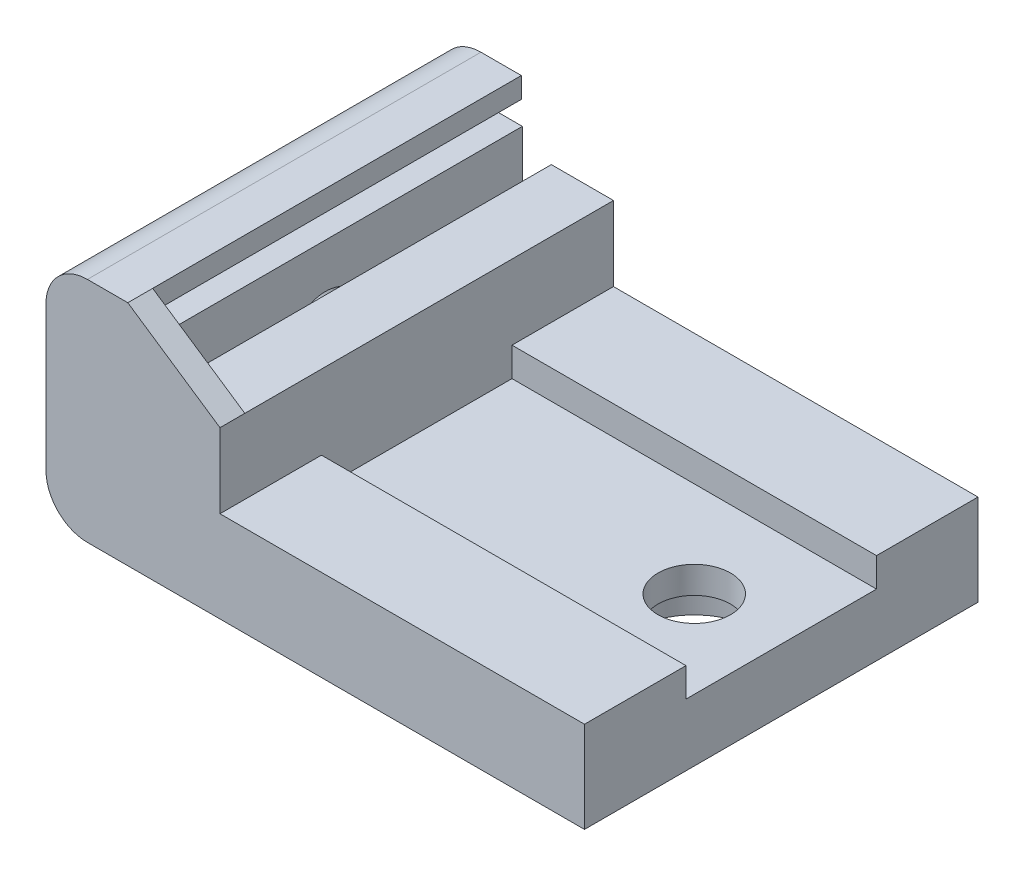
ISO-10303-21;
HEADER;
FILE_DESCRIPTION(('STEP AP214'),'2;1');
FILE_NAME('part.step','',(''),(''),'','','');
FILE_SCHEMA(('AUTOMOTIVE_DESIGN { 1 0 10303 214 1 1 1 1 }'));
ENDSEC;
DATA;
#1=APPLICATION_CONTEXT('core data for automotive mechanical design processes');
#2=APPLICATION_PROTOCOL_DEFINITION('international standard','automotive_design',2000,#1);
#3=PRODUCT_CONTEXT('',#1,'mechanical');
#4=PRODUCT('Part','Part','',(#3));
#5=PRODUCT_RELATED_PRODUCT_CATEGORY('part','',(#4));
#6=PRODUCT_DEFINITION_FORMATION('','',#4);
#7=PRODUCT_DEFINITION_CONTEXT('part definition',#1,'design');
#8=PRODUCT_DEFINITION('design','',#6,#7);
#9=PRODUCT_DEFINITION_SHAPE('','',#8);
#10=(LENGTH_UNIT() NAMED_UNIT(*) SI_UNIT(.MILLI.,.METRE.));
#11=(NAMED_UNIT(*) PLANE_ANGLE_UNIT() SI_UNIT($,.RADIAN.));
#12=(NAMED_UNIT(*) SI_UNIT($,.STERADIAN.) SOLID_ANGLE_UNIT());
#13=UNCERTAINTY_MEASURE_WITH_UNIT(LENGTH_MEASURE(1.E-05),#10,'distance_accuracy_value','');
#14=(GEOMETRIC_REPRESENTATION_CONTEXT(3) GLOBAL_UNCERTAINTY_ASSIGNED_CONTEXT((#13)) GLOBAL_UNIT_ASSIGNED_CONTEXT((#10,
#11,#12)) REPRESENTATION_CONTEXT('',''));
#15=CARTESIAN_POINT('',(0.,0.,0.));
#16=DIRECTION('',(0.,0.,1.));
#17=DIRECTION('',(1.,0.,0.));
#18=AXIS2_PLACEMENT_3D('',#15,#16,#17);
#19=CARTESIAN_POINT('',(0.,3.,0.));
#20=DIRECTION('',(0.,-1.,0.));
#21=DIRECTION('',(0.,0.,-1.));
#22=AXIS2_PLACEMENT_3D('',#19,#20,#21);
#23=PLANE('',#22);
#24=CARTESIAN_POINT('',(18.8,3.,-9.5));
#25=DIRECTION('',(0.,1.,0.));
#26=DIRECTION('',(0.,0.,1.));
#27=AXIS2_PLACEMENT_3D('',#24,#25,#26);
#28=CIRCLE('',#27,1.75);
#29=CARTESIAN_POINT('',(18.8,3.,-7.75));
#30=VERTEX_POINT('',#29);
#31=EDGE_CURVE('E285',#30,#30,#28,.T.);
#32=ORIENTED_EDGE('',*,*,#31,.F.);
#33=EDGE_LOOP('',(#32));
#34=FACE_BOUND('',#33,.T.);
#35=DIRECTION('',(1.,0.,0.));
#36=VECTOR('',#35,1.);
#37=CARTESIAN_POINT('',(23.,3.,-14.1));
#38=LINE('',#37,#36);
#39=CARTESIAN_POINT('',(5.4,3.,-14.1));
#40=VERTEX_POINT('',#39);
#41=CARTESIAN_POINT('',(23.,3.,-14.1));
#42=VERTEX_POINT('',#41);
#43=EDGE_CURVE('E232',#40,#42,#38,.T.);
#44=ORIENTED_EDGE('',*,*,#43,.F.);
#45=DIRECTION('',(0.,0.,-1.));
#46=VECTOR('',#45,1.);
#47=CARTESIAN_POINT('',(5.4,3.,0.));
#48=LINE('',#47,#46);
#49=CARTESIAN_POINT('',(5.4,3.,-4.9));
#50=VERTEX_POINT('',#49);
#51=EDGE_CURVE('E298',#50,#40,#48,.T.);
#52=ORIENTED_EDGE('',*,*,#51,.F.);
#53=DIRECTION('',(-1.,0.,0.));
#54=VECTOR('',#53,1.);
#55=CARTESIAN_POINT('',(5.4,3.,-4.9));
#56=LINE('',#55,#54);
#57=CARTESIAN_POINT('',(23.,3.,-4.9));
#58=VERTEX_POINT('',#57);
#59=EDGE_CURVE('E236',#58,#50,#56,.T.);
#60=ORIENTED_EDGE('',*,*,#59,.F.);
#61=DIRECTION('',(0.,0.,-1.));
#62=VECTOR('',#61,1.);
#63=CARTESIAN_POINT('',(23.,3.,0.));
#64=LINE('',#63,#62);
#65=EDGE_CURVE('E354',#58,#42,#64,.T.);
#66=ORIENTED_EDGE('',*,*,#65,.T.);
#67=EDGE_LOOP('',(#44,#52,#60,#66));
#68=FACE_BOUND('',#67,.T.);
#69=ADVANCED_FACE('F47',(#34,#68),#23,.F.);
#70=CARTESIAN_POINT('',(5.4,8.,0.));
#71=DIRECTION('',(-1.,0.,0.));
#72=DIRECTION('',(0.,0.,1.));
#73=AXIS2_PLACEMENT_3D('',#70,#71,#72);
#74=PLANE('',#73);
#75=DIRECTION('',(0.,-1.,0.));
#76=VECTOR('',#75,1.);
#77=CARTESIAN_POINT('',(5.4,4.4,-14.1));
#78=LINE('',#77,#76);
#79=CARTESIAN_POINT('',(5.4,4.4,-14.1));
#80=VERTEX_POINT('',#79);
#81=EDGE_CURVE('E216',#80,#40,#78,.T.);
#82=ORIENTED_EDGE('',*,*,#81,.F.);
#83=DIRECTION('',(0.,0.,1.));
#84=VECTOR('',#83,1.);
#85=CARTESIAN_POINT('',(5.4,4.4,-14.1));
#86=LINE('',#85,#84);
#87=CARTESIAN_POINT('',(5.4,4.4,-19.));
#88=VERTEX_POINT('',#87);
#89=EDGE_CURVE('E240',#88,#80,#86,.T.);
#90=ORIENTED_EDGE('',*,*,#89,.F.);
#91=DIRECTION('',(0.,-1.,0.));
#92=VECTOR('',#91,1.);
#93=CARTESIAN_POINT('',(5.4,8.,-19.));
#94=LINE('',#93,#92);
#95=CARTESIAN_POINT('',(5.4,8.,-19.));
#96=VERTEX_POINT('',#95);
#97=EDGE_CURVE('E344',#96,#88,#94,.T.);
#98=ORIENTED_EDGE('',*,*,#97,.F.);
#99=DIRECTION('',(0.,0.,-1.));
#100=VECTOR('',#99,1.);
#101=CARTESIAN_POINT('',(5.4,8.,0.));
#102=LINE('',#101,#100);
#103=CARTESIAN_POINT('',(5.4,8.,-1.2));
#104=VERTEX_POINT('',#103);
#105=EDGE_CURVE('E330',#104,#96,#102,.T.);
#106=ORIENTED_EDGE('',*,*,#105,.F.);
#107=CARTESIAN_POINT('',(5.4,8.,0.));
#108=VERTEX_POINT('',#107);
#109=EDGE_CURVE('E326',#108,#104,#102,.T.);
#110=ORIENTED_EDGE('',*,*,#109,.F.);
#111=DIRECTION('',(0.,-1.,0.));
#112=VECTOR('',#111,1.);
#113=CARTESIAN_POINT('',(5.4,8.,0.));
#114=LINE('',#113,#112);
#115=CARTESIAN_POINT('',(5.4,4.4,0.));
#116=VERTEX_POINT('',#115);
#117=EDGE_CURVE('E348',#108,#116,#114,.T.);
#118=ORIENTED_EDGE('',*,*,#117,.T.);
#119=DIRECTION('',(0.,0.,1.));
#120=VECTOR('',#119,1.);
#121=CARTESIAN_POINT('',(5.4,4.4,0.));
#122=LINE('',#121,#120);
#123=CARTESIAN_POINT('',(5.4,4.4,-4.9));
#124=VERTEX_POINT('',#123);
#125=EDGE_CURVE('E251',#124,#116,#122,.T.);
#126=ORIENTED_EDGE('',*,*,#125,.F.);
#127=DIRECTION('',(0.,-1.,0.));
#128=VECTOR('',#127,1.);
#129=CARTESIAN_POINT('',(5.4,4.4,-4.9));
#130=LINE('',#129,#128);
#131=EDGE_CURVE('E266',#124,#50,#130,.T.);
#132=ORIENTED_EDGE('',*,*,#131,.T.);
#133=ORIENTED_EDGE('',*,*,#51,.T.);
#134=EDGE_LOOP('',(#82,#90,#98,#106,#110,#118,#126,#132,#133));
#135=FACE_BOUND('',#134,.T.);
#136=ADVANCED_FACE('F440',(#135),#74,.F.);
#137=CARTESIAN_POINT('',(18.8,0.,-9.5));
#138=DIRECTION('',(0.,1.,0.));
#139=DIRECTION('',(0.,0.,1.));
#140=AXIS2_PLACEMENT_3D('',#137,#138,#139);
#141=CYLINDRICAL_SURFACE('',#140,1.75);
#142=ORIENTED_EDGE('',*,*,#31,.T.);
#143=EDGE_LOOP('',(#142));
#144=FACE_BOUND('',#143,.T.);
#145=CARTESIAN_POINT('',(18.8,1.7,-9.5));
#146=DIRECTION('',(0.,-1.,0.));
#147=DIRECTION('',(0.,0.,-1.));
#148=AXIS2_PLACEMENT_3D('',#145,#146,#147);
#149=CIRCLE('',#148,1.75);
#150=CARTESIAN_POINT('',(18.8,1.7,-11.25));
#151=VERTEX_POINT('',#150);
#152=EDGE_CURVE('E281',#151,#151,#149,.F.);
#153=ORIENTED_EDGE('',*,*,#152,.F.);
#154=EDGE_LOOP('',(#153));
#155=FACE_BOUND('',#154,.T.);
#156=ADVANCED_FACE('F531',(#144,#155),#141,.F.);
#157=CARTESIAN_POINT('',(0.,3.,0.));
#158=DIRECTION('',(0.,0.,-1.));
#159=DIRECTION('',(-1.,0.,0.));
#160=AXIS2_PLACEMENT_3D('',#157,#158,#159);
#161=PLANE('',#160);
#162=DIRECTION('',(0.,-1.,0.));
#163=VECTOR('',#162,1.);
#164=CARTESIAN_POINT('',(-3.,8.,0.));
#165=LINE('',#164,#163);
#166=CARTESIAN_POINT('',(-3.,9.,0.));
#167=VERTEX_POINT('',#166);
#168=CARTESIAN_POINT('',(-3.,2.,0.));
#169=VERTEX_POINT('',#168);
#170=EDGE_CURVE('E290',#167,#169,#165,.T.);
#171=ORIENTED_EDGE('',*,*,#170,.T.);
#172=CARTESIAN_POINT('',(-1.,2.,0.));
#173=DIRECTION('',(0.,0.,-1.));
#174=DIRECTION('',(-1.,0.,0.));
#175=AXIS2_PLACEMENT_3D('',#172,#173,#174);
#176=CIRCLE('',#175,2.);
#177=CARTESIAN_POINT('',(-1.,0.,0.));
#178=VERTEX_POINT('',#177);
#179=EDGE_CURVE('E11',#169,#178,#176,.F.);
#180=ORIENTED_EDGE('',*,*,#179,.T.);
#181=DIRECTION('',(1.,0.,0.));
#182=VECTOR('',#181,1.);
#183=CARTESIAN_POINT('',(0.,0.,0.));
#184=LINE('',#183,#182);
#185=CARTESIAN_POINT('',(23.,0.,0.));
#186=VERTEX_POINT('',#185);
#187=EDGE_CURVE('E353',#178,#186,#184,.T.);
#188=ORIENTED_EDGE('',*,*,#187,.T.);
#189=DIRECTION('',(0.,-1.,0.));
#190=VECTOR('',#189,1.);
#191=CARTESIAN_POINT('',(23.,3.,0.));
#192=LINE('',#191,#190);
#193=CARTESIAN_POINT('',(23.,4.4,0.));
#194=VERTEX_POINT('',#193);
#195=EDGE_CURVE('E369',#194,#186,#192,.T.);
#196=ORIENTED_EDGE('',*,*,#195,.F.);
#197=DIRECTION('',(1.,0.,0.));
#198=VECTOR('',#197,1.);
#199=CARTESIAN_POINT('',(5.4,4.4,0.));
#200=LINE('',#199,#198);
#201=EDGE_CURVE('E255',#116,#194,#200,.T.);
#202=ORIENTED_EDGE('',*,*,#201,.F.);
#203=ORIENTED_EDGE('',*,*,#117,.F.);
#204=DIRECTION('',(-0.829172554045034,0.558992733064067,0.));
#205=VECTOR('',#204,1.);
#206=CARTESIAN_POINT('',(0.95,11.,0.));
#207=LINE('',#206,#205);
#208=CARTESIAN_POINT('',(0.95,11.,0.));
#209=VERTEX_POINT('',#208);
#210=EDGE_CURVE('E209',#108,#209,#207,.T.);
#211=ORIENTED_EDGE('',*,*,#210,.T.);
#212=DIRECTION('',(-1.,0.,0.));
#213=VECTOR('',#212,1.);
#214=CARTESIAN_POINT('',(-3.,11.,0.));
#215=LINE('',#214,#213);
#216=CARTESIAN_POINT('',(-0.999999999999999,11.,0.));
#217=VERTEX_POINT('',#216);
#218=EDGE_CURVE('E293',#209,#217,#215,.T.);
#219=ORIENTED_EDGE('',*,*,#218,.T.);
#220=CARTESIAN_POINT('',(-1.,9.,0.));
#221=DIRECTION('',(0.,0.,-1.));
#222=DIRECTION('',(-1.,0.,0.));
#223=AXIS2_PLACEMENT_3D('',#220,#221,#222);
#224=CIRCLE('',#223,2.);
#225=EDGE_CURVE('E386',#217,#167,#224,.F.);
#226=ORIENTED_EDGE('',*,*,#225,.T.);
#227=EDGE_LOOP('',(#171,#180,#188,#196,#202,#203,#211,#219,#226));
#228=FACE_BOUND('',#227,.T.);
#229=ADVANCED_FACE('F419',(#228),#161,.F.);
#230=CARTESIAN_POINT('',(23.,3.,0.));
#231=DIRECTION('',(-1.,0.,0.));
#232=DIRECTION('',(0.,0.,1.));
#233=AXIS2_PLACEMENT_3D('',#230,#231,#232);
#234=PLANE('',#233);
#235=DIRECTION('',(0.,0.,-1.));
#236=VECTOR('',#235,1.);
#237=CARTESIAN_POINT('',(23.,0.,0.));
#238=LINE('',#237,#236);
#239=CARTESIAN_POINT('',(23.,0.,-19.));
#240=VERTEX_POINT('',#239);
#241=EDGE_CURVE('E361',#186,#240,#238,.T.);
#242=ORIENTED_EDGE('',*,*,#241,.T.);
#243=DIRECTION('',(0.,-1.,0.));
#244=VECTOR('',#243,1.);
#245=CARTESIAN_POINT('',(23.,3.,-19.));
#246=LINE('',#245,#244);
#247=CARTESIAN_POINT('',(23.,4.4,-19.));
#248=VERTEX_POINT('',#247);
#249=EDGE_CURVE('E357',#248,#240,#246,.T.);
#250=ORIENTED_EDGE('',*,*,#249,.F.);
#251=DIRECTION('',(0.,0.,-1.));
#252=VECTOR('',#251,1.);
#253=CARTESIAN_POINT('',(23.,4.4,-14.1));
#254=LINE('',#253,#252);
#255=CARTESIAN_POINT('',(23.,4.4,-14.1));
#256=VERTEX_POINT('',#255);
#257=EDGE_CURVE('E237',#256,#248,#254,.T.);
#258=ORIENTED_EDGE('',*,*,#257,.F.);
#259=DIRECTION('',(0.,-1.,0.));
#260=VECTOR('',#259,1.);
#261=CARTESIAN_POINT('',(23.,4.4,-14.1));
#262=LINE('',#261,#260);
#263=EDGE_CURVE('E221',#256,#42,#262,.T.);
#264=ORIENTED_EDGE('',*,*,#263,.T.);
#265=ORIENTED_EDGE('',*,*,#65,.F.);
#266=DIRECTION('',(0.,-1.,0.));
#267=VECTOR('',#266,1.);
#268=CARTESIAN_POINT('',(23.,4.4,-4.9));
#269=LINE('',#268,#267);
#270=CARTESIAN_POINT('',(23.,4.4,-4.9));
#271=VERTEX_POINT('',#270);
#272=EDGE_CURVE('E272',#271,#58,#269,.T.);
#273=ORIENTED_EDGE('',*,*,#272,.F.);
#274=DIRECTION('',(0.,0.,-1.));
#275=VECTOR('',#274,1.);
#276=CARTESIAN_POINT('',(23.,4.4,0.));
#277=LINE('',#276,#275);
#278=EDGE_CURVE('E259',#194,#271,#277,.T.);
#279=ORIENTED_EDGE('',*,*,#278,.F.);
#280=ORIENTED_EDGE('',*,*,#195,.T.);
#281=EDGE_LOOP('',(#242,#250,#258,#264,#265,#273,#279,#280));
#282=FACE_BOUND('',#281,.T.);
#283=ADVANCED_FACE('F430',(#282),#234,.F.);
#284=CARTESIAN_POINT('',(0.,3.,-19.));
#285=DIRECTION('',(0.,0.,1.));
#286=DIRECTION('',(1.,0.,0.));
#287=AXIS2_PLACEMENT_3D('',#284,#285,#286);
#288=PLANE('',#287);
#289=DIRECTION('',(-1.,0.,0.));
#290=VECTOR('',#289,1.);
#291=CARTESIAN_POINT('',(0.,0.,-19.));
#292=LINE('',#291,#290);
#293=CARTESIAN_POINT('',(-1.,0.,-19.));
#294=VERTEX_POINT('',#293);
#295=EDGE_CURVE('E358',#240,#294,#292,.T.);
#296=ORIENTED_EDGE('',*,*,#295,.T.);
#297=CARTESIAN_POINT('',(-1.,2.,-19.));
#298=DIRECTION('',(0.,0.,1.));
#299=DIRECTION('',(1.,0.,0.));
#300=AXIS2_PLACEMENT_3D('',#297,#298,#299);
#301=CIRCLE('',#300,2.);
#302=CARTESIAN_POINT('',(-3.,2.,-19.));
#303=VERTEX_POINT('',#302);
#304=EDGE_CURVE('E70',#294,#303,#301,.F.);
#305=ORIENTED_EDGE('',*,*,#304,.T.);
#306=DIRECTION('',(0.,1.,0.));
#307=VECTOR('',#306,1.);
#308=CARTESIAN_POINT('',(-3.,8.,-19.));
#309=LINE('',#308,#307);
#310=CARTESIAN_POINT('',(-3.,9.,-19.));
#311=VERTEX_POINT('',#310);
#312=EDGE_CURVE('E289',#303,#311,#309,.T.);
#313=ORIENTED_EDGE('',*,*,#312,.T.);
#314=CARTESIAN_POINT('',(-1.,9.,-19.));
#315=DIRECTION('',(0.,0.,1.));
#316=DIRECTION('',(1.,0.,0.));
#317=AXIS2_PLACEMENT_3D('',#314,#315,#316);
#318=CIRCLE('',#317,2.);
#319=CARTESIAN_POINT('',(-0.999999999999999,11.,-19.));
#320=VERTEX_POINT('',#319);
#321=EDGE_CURVE('E380',#311,#320,#318,.F.);
#322=ORIENTED_EDGE('',*,*,#321,.T.);
#323=DIRECTION('',(1.,0.,0.));
#324=VECTOR('',#323,1.);
#325=CARTESIAN_POINT('',(-3.,11.,-19.));
#326=LINE('',#325,#324);
#327=CARTESIAN_POINT('',(0.95,11.,-19.));
#328=VERTEX_POINT('',#327);
#329=EDGE_CURVE('E301',#320,#328,#326,.T.);
#330=ORIENTED_EDGE('',*,*,#329,.T.);
#331=DIRECTION('',(0.,-1.,0.));
#332=VECTOR('',#331,1.);
#333=CARTESIAN_POINT('',(0.95,11.,-19.));
#334=LINE('',#333,#332);
#335=CARTESIAN_POINT('',(0.95,10.,-19.));
#336=VERTEX_POINT('',#335);
#337=EDGE_CURVE('E304',#328,#336,#334,.T.);
#338=ORIENTED_EDGE('',*,*,#337,.T.);
#339=DIRECTION('',(-1.,0.,0.));
#340=VECTOR('',#339,1.);
#341=CARTESIAN_POINT('',(0.95,10.,-19.));
#342=LINE('',#341,#340);
#343=CARTESIAN_POINT('',(-1.5,10.,-19.));
#344=VERTEX_POINT('',#343);
#345=EDGE_CURVE('E308',#336,#344,#342,.T.);
#346=ORIENTED_EDGE('',*,*,#345,.T.);
#347=DIRECTION('',(0.,-1.,0.));
#348=VECTOR('',#347,1.);
#349=CARTESIAN_POINT('',(-1.5,10.,-19.));
#350=LINE('',#349,#348);
#351=CARTESIAN_POINT('',(-1.5,8.9,-19.));
#352=VERTEX_POINT('',#351);
#353=EDGE_CURVE('E312',#344,#352,#350,.T.);
#354=ORIENTED_EDGE('',*,*,#353,.T.);
#355=DIRECTION('',(1.,0.,0.));
#356=VECTOR('',#355,1.);
#357=CARTESIAN_POINT('',(1.,8.9,-19.));
#358=LINE('',#357,#356);
#359=CARTESIAN_POINT('',(1.,8.9,-19.));
#360=VERTEX_POINT('',#359);
#361=EDGE_CURVE('E223',#352,#360,#358,.T.);
#362=ORIENTED_EDGE('',*,*,#361,.T.);
#363=DIRECTION('',(0.,-1.,0.));
#364=VECTOR('',#363,1.);
#365=CARTESIAN_POINT('',(1.,8.,-19.));
#366=LINE('',#365,#364);
#367=CARTESIAN_POINT('',(1.,2.2,-19.));
#368=VERTEX_POINT('',#367);
#369=EDGE_CURVE('E213',#360,#368,#366,.T.);
#370=ORIENTED_EDGE('',*,*,#369,.T.);
#371=DIRECTION('',(-1.,0.,0.));
#372=VECTOR('',#371,1.);
#373=CARTESIAN_POINT('',(1.,2.2,-19.));
#374=LINE('',#373,#372);
#375=CARTESIAN_POINT('',(2.4,2.2,-19.));
#376=VERTEX_POINT('',#375);
#377=EDGE_CURVE('E457',#376,#368,#374,.T.);
#378=ORIENTED_EDGE('',*,*,#377,.F.);
#379=DIRECTION('',(0.,-1.,0.));
#380=VECTOR('',#379,1.);
#381=CARTESIAN_POINT('',(2.4,8.,-19.));
#382=LINE('',#381,#380);
#383=CARTESIAN_POINT('',(2.4,8.,-19.));
#384=VERTEX_POINT('',#383);
#385=EDGE_CURVE('E337',#384,#376,#382,.T.);
#386=ORIENTED_EDGE('',*,*,#385,.F.);
#387=DIRECTION('',(-1.,0.,0.));
#388=VECTOR('',#387,1.);
#389=CARTESIAN_POINT('',(0.,8.,-19.));
#390=LINE('',#389,#388);
#391=EDGE_CURVE('E329',#96,#384,#390,.T.);
#392=ORIENTED_EDGE('',*,*,#391,.F.);
#393=ORIENTED_EDGE('',*,*,#97,.T.);
#394=DIRECTION('',(-1.,0.,0.));
#395=VECTOR('',#394,1.);
#396=CARTESIAN_POINT('',(23.,4.4,-19.));
#397=LINE('',#396,#395);
#398=EDGE_CURVE('E244',#248,#88,#397,.T.);
#399=ORIENTED_EDGE('',*,*,#398,.F.);
#400=ORIENTED_EDGE('',*,*,#249,.T.);
#401=EDGE_LOOP('',(#296,#305,#313,#322,#330,#338,#346,#354,#362,#370,#378,#386,#392,#393,#399,#400));
#402=FACE_BOUND('',#401,.T.);
#403=ADVANCED_FACE('F410',(#402),#288,.F.);
#404=CARTESIAN_POINT('',(0.,0.,0.));
#405=DIRECTION('',(0.,-1.,0.));
#406=DIRECTION('',(0.,0.,-1.));
#407=AXIS2_PLACEMENT_3D('',#404,#405,#406);
#408=PLANE('',#407);
#409=CARTESIAN_POINT('',(18.8,0.,-9.5));
#410=DIRECTION('',(0.,-1.,0.));
#411=DIRECTION('',(0.,0.,-1.));
#412=AXIS2_PLACEMENT_3D('',#409,#410,#411);
#413=CIRCLE('',#412,3.);
#414=CARTESIAN_POINT('',(18.8,0.,-12.5));
#415=VERTEX_POINT('',#414);
#416=EDGE_CURVE('E276',#415,#415,#413,.T.);
#417=ORIENTED_EDGE('',*,*,#416,.F.);
#418=EDGE_LOOP('',(#417));
#419=FACE_BOUND('',#418,.T.);
#420=ORIENTED_EDGE('',*,*,#187,.F.);
#421=DIRECTION('',(0.,0.,-1.));
#422=VECTOR('',#421,1.);
#423=CARTESIAN_POINT('',(-1.,0.,0.));
#424=LINE('',#423,#422);
#425=EDGE_CURVE('E389',#178,#294,#424,.T.);
#426=ORIENTED_EDGE('',*,*,#425,.T.);
#427=ORIENTED_EDGE('',*,*,#295,.F.);
#428=ORIENTED_EDGE('',*,*,#241,.F.);
#429=EDGE_LOOP('',(#420,#426,#427,#428));
#430=FACE_BOUND('',#429,.T.);
#431=ADVANCED_FACE('F425',(#419,#430),#408,.T.);
#432=CARTESIAN_POINT('',(1.,8.,0.));
#433=DIRECTION('',(1.,0.,0.));
#434=DIRECTION('',(0.,0.,-1.));
#435=AXIS2_PLACEMENT_3D('',#432,#433,#434);
#436=PLANE('',#435);
#437=CARTESIAN_POINT('',(1.,5.,-9.5));
#438=DIRECTION('',(1.,0.,0.));
#439=DIRECTION('',(0.,0.,-1.));
#440=AXIS2_PLACEMENT_3D('',#437,#438,#439);
#441=CIRCLE('',#440,1.75);
#442=CARTESIAN_POINT('',(1.,5.,-11.25));
#443=VERTEX_POINT('',#442);
#444=EDGE_CURVE('E451',#443,#443,#441,.F.);
#445=ORIENTED_EDGE('',*,*,#444,.T.);
#446=EDGE_LOOP('',(#445));
#447=FACE_BOUND('',#446,.T.);
#448=DIRECTION('',(0.,-1.,0.));
#449=VECTOR('',#448,1.);
#450=CARTESIAN_POINT('',(1.,2.2,-1.2));
#451=LINE('',#450,#449);
#452=CARTESIAN_POINT('',(1.,8.9,-1.2));
#453=VERTEX_POINT('',#452);
#454=CARTESIAN_POINT('',(1.,2.2,-1.2));
#455=VERTEX_POINT('',#454);
#456=EDGE_CURVE('E189',#453,#455,#451,.T.);
#457=ORIENTED_EDGE('',*,*,#456,.T.);
#458=DIRECTION('',(0.,0.,-1.));
#459=VECTOR('',#458,1.);
#460=CARTESIAN_POINT('',(1.,2.2,0.));
#461=LINE('',#460,#459);
#462=EDGE_CURVE('E462',#455,#368,#461,.T.);
#463=ORIENTED_EDGE('',*,*,#462,.T.);
#464=ORIENTED_EDGE('',*,*,#369,.F.);
#465=DIRECTION('',(0.,0.,-1.));
#466=VECTOR('',#465,1.);
#467=CARTESIAN_POINT('',(1.,8.9,2.65706605111728));
#468=LINE('',#467,#466);
#469=EDGE_CURVE('E205',#453,#360,#468,.T.);
#470=ORIENTED_EDGE('',*,*,#469,.F.);
#471=EDGE_LOOP('',(#457,#463,#464,#470));
#472=FACE_BOUND('',#471,.T.);
#473=ADVANCED_FACE('F211',(#447,#472),#436,.T.);
#474=CARTESIAN_POINT('',(2.4,8.,0.));
#475=DIRECTION('',(-1.,0.,0.));
#476=DIRECTION('',(0.,0.,1.));
#477=AXIS2_PLACEMENT_3D('',#474,#475,#476);
#478=PLANE('',#477);
#479=DIRECTION('',(0.,1.,0.));
#480=VECTOR('',#479,1.);
#481=CARTESIAN_POINT('',(2.4,8.,-1.2));
#482=LINE('',#481,#480);
#483=CARTESIAN_POINT('',(2.4,2.2,-1.2));
#484=VERTEX_POINT('',#483);
#485=CARTESIAN_POINT('',(2.4,8.,-1.2));
#486=VERTEX_POINT('',#485);
#487=EDGE_CURVE('E497',#484,#486,#482,.T.);
#488=ORIENTED_EDGE('',*,*,#487,.T.);
#489=DIRECTION('',(0.,0.,-1.));
#490=VECTOR('',#489,1.);
#491=CARTESIAN_POINT('',(2.4,8.,0.));
#492=LINE('',#491,#490);
#493=EDGE_CURVE('E334',#486,#384,#492,.T.);
#494=ORIENTED_EDGE('',*,*,#493,.T.);
#495=ORIENTED_EDGE('',*,*,#385,.T.);
#496=DIRECTION('',(0.,0.,-1.));
#497=VECTOR('',#496,1.);
#498=CARTESIAN_POINT('',(2.4,2.2,0.));
#499=LINE('',#498,#497);
#500=EDGE_CURVE('E461',#484,#376,#499,.T.);
#501=ORIENTED_EDGE('',*,*,#500,.F.);
#502=EDGE_LOOP('',(#488,#494,#495,#501));
#503=FACE_BOUND('',#502,.T.);
#504=ADVANCED_FACE('F472',(#503),#478,.T.);
#505=CARTESIAN_POINT('',(0.,8.,0.));
#506=DIRECTION('',(0.,1.,0.));
#507=DIRECTION('',(0.,0.,1.));
#508=AXIS2_PLACEMENT_3D('',#505,#506,#507);
#509=PLANE('',#508);
#510=DIRECTION('',(1.,0.,0.));
#511=VECTOR('',#510,1.);
#512=CARTESIAN_POINT('',(5.4,8.,-1.2));
#513=LINE('',#512,#511);
#514=EDGE_CURVE('E493',#486,#104,#513,.T.);
#515=ORIENTED_EDGE('',*,*,#514,.T.);
#516=ORIENTED_EDGE('',*,*,#105,.T.);
#517=ORIENTED_EDGE('',*,*,#391,.T.);
#518=ORIENTED_EDGE('',*,*,#493,.F.);
#519=EDGE_LOOP('',(#515,#516,#517,#518));
#520=FACE_BOUND('',#519,.T.);
#521=ADVANCED_FACE('F677',(#520),#509,.T.);
#522=CARTESIAN_POINT('',(-1.5,10.,11.6877072174144));
#523=DIRECTION('',(1.,0.,0.));
#524=DIRECTION('',(0.,1.,0.));
#525=AXIS2_PLACEMENT_3D('',#522,#523,#524);
#526=PLANE('',#525);
#527=DIRECTION('',(0.,-1.,0.));
#528=VECTOR('',#527,1.);
#529=CARTESIAN_POINT('',(-1.5,8.9,-1.2));
#530=LINE('',#529,#528);
#531=CARTESIAN_POINT('',(-1.5,10.,-1.2));
#532=VERTEX_POINT('',#531);
#533=CARTESIAN_POINT('',(-1.5,8.9,-1.2));
#534=VERTEX_POINT('',#533);
#535=EDGE_CURVE('E455',#532,#534,#530,.T.);
#536=ORIENTED_EDGE('',*,*,#535,.T.);
#537=DIRECTION('',(0.,0.,-1.));
#538=VECTOR('',#537,1.);
#539=CARTESIAN_POINT('',(-1.5,8.9,2.65706605111728));
#540=LINE('',#539,#538);
#541=EDGE_CURVE('E207',#534,#352,#540,.T.);
#542=ORIENTED_EDGE('',*,*,#541,.T.);
#543=ORIENTED_EDGE('',*,*,#353,.F.);
#544=DIRECTION('',(0.,0.,-1.));
#545=VECTOR('',#544,1.);
#546=CARTESIAN_POINT('',(-1.5,10.,11.6877072174144));
#547=LINE('',#546,#545);
#548=EDGE_CURVE('E294',#532,#344,#547,.T.);
#549=ORIENTED_EDGE('',*,*,#548,.F.);
#550=EDGE_LOOP('',(#536,#542,#543,#549));
#551=FACE_BOUND('',#550,.T.);
#552=ADVANCED_FACE('F479',(#551),#526,.T.);
#553=CARTESIAN_POINT('',(0.95,10.,11.6877072174144));
#554=DIRECTION('',(0.,-1.,0.));
#555=DIRECTION('',(0.,0.,-1.));
#556=AXIS2_PLACEMENT_3D('',#553,#554,#555);
#557=PLANE('',#556);
#558=DIRECTION('',(-1.,0.,0.));
#559=VECTOR('',#558,1.);
#560=CARTESIAN_POINT('',(-1.5,10.,-1.2));
#561=LINE('',#560,#559);
#562=CARTESIAN_POINT('',(0.95,10.,-1.2));
#563=VERTEX_POINT('',#562);
#564=EDGE_CURVE('E482',#563,#532,#561,.T.);
#565=ORIENTED_EDGE('',*,*,#564,.T.);
#566=ORIENTED_EDGE('',*,*,#548,.T.);
#567=ORIENTED_EDGE('',*,*,#345,.F.);
#568=DIRECTION('',(0.,0.,-1.));
#569=VECTOR('',#568,1.);
#570=CARTESIAN_POINT('',(0.95,10.,11.6877072174144));
#571=LINE('',#570,#569);
#572=EDGE_CURVE('E319',#563,#336,#571,.T.);
#573=ORIENTED_EDGE('',*,*,#572,.F.);
#574=EDGE_LOOP('',(#565,#566,#567,#573));
#575=FACE_BOUND('',#574,.T.);
#576=ADVANCED_FACE('F659',(#575),#557,.T.);
#577=CARTESIAN_POINT('',(0.95,11.,11.6877072174144));
#578=DIRECTION('',(1.,0.,0.));
#579=DIRECTION('',(0.,1.,0.));
#580=AXIS2_PLACEMENT_3D('',#577,#578,#579);
#581=PLANE('',#580);
#582=DIRECTION('',(0.,-1.,0.));
#583=VECTOR('',#582,1.);
#584=CARTESIAN_POINT('',(0.95,10.,-1.2));
#585=LINE('',#584,#583);
#586=CARTESIAN_POINT('',(0.95,11.,-1.2));
#587=VERTEX_POINT('',#586);
#588=EDGE_CURVE('E484',#587,#563,#585,.T.);
#589=ORIENTED_EDGE('',*,*,#588,.T.);
#590=ORIENTED_EDGE('',*,*,#572,.T.);
#591=ORIENTED_EDGE('',*,*,#337,.F.);
#592=DIRECTION('',(0.,0.,-1.));
#593=VECTOR('',#592,1.);
#594=CARTESIAN_POINT('',(0.95,11.,11.6877072174144));
#595=LINE('',#594,#593);
#596=EDGE_CURVE('E316',#587,#328,#595,.T.);
#597=ORIENTED_EDGE('',*,*,#596,.F.);
#598=EDGE_LOOP('',(#589,#590,#591,#597));
#599=FACE_BOUND('',#598,.T.);
#600=ADVANCED_FACE('F407',(#599),#581,.T.);
#601=CARTESIAN_POINT('',(-3.,11.,11.6877072174144));
#602=DIRECTION('',(0.,1.,0.));
#603=DIRECTION('',(-1.,0.,0.));
#604=AXIS2_PLACEMENT_3D('',#601,#602,#603);
#605=PLANE('',#604);
#606=ORIENTED_EDGE('',*,*,#329,.F.);
#607=DIRECTION('',(0.,0.,-1.));
#608=VECTOR('',#607,1.);
#609=CARTESIAN_POINT('',(-0.999999999999999,11.,11.6877072174144));
#610=LINE('',#609,#608);
#611=EDGE_CURVE('E383',#320,#217,#610,.F.);
#612=ORIENTED_EDGE('',*,*,#611,.T.);
#613=ORIENTED_EDGE('',*,*,#218,.F.);
#614=EDGE_CURVE('E322',#209,#587,#595,.T.);
#615=ORIENTED_EDGE('',*,*,#614,.T.);
#616=ORIENTED_EDGE('',*,*,#596,.T.);
#617=EDGE_LOOP('',(#606,#612,#613,#615,#616));
#618=FACE_BOUND('',#617,.T.);
#619=ADVANCED_FACE('F402',(#618),#605,.T.);
#620=CARTESIAN_POINT('',(-3.,8.,11.6877072174144));
#621=DIRECTION('',(-1.,0.,0.));
#622=DIRECTION('',(0.,-1.,0.));
#623=AXIS2_PLACEMENT_3D('',#620,#621,#622);
#624=PLANE('',#623);
#625=CARTESIAN_POINT('',(-3.,5.,-9.5));
#626=DIRECTION('',(-1.,0.,0.));
#627=DIRECTION('',(0.,-1.,0.));
#628=AXIS2_PLACEMENT_3D('',#625,#626,#627);
#629=CIRCLE('',#628,1.75);
#630=CARTESIAN_POINT('',(-3.,3.25,-9.5));
#631=VERTEX_POINT('',#630);
#632=EDGE_CURVE('E447',#631,#631,#629,.T.);
#633=ORIENTED_EDGE('',*,*,#632,.F.);
#634=EDGE_LOOP('',(#633));
#635=FACE_BOUND('',#634,.T.);
#636=ORIENTED_EDGE('',*,*,#312,.F.);
#637=DIRECTION('',(0.,0.,-1.));
#638=VECTOR('',#637,1.);
#639=CARTESIAN_POINT('',(-3.,2.,11.6877072174144));
#640=LINE('',#639,#638);
#641=EDGE_CURVE('E56',#303,#169,#640,.F.);
#642=ORIENTED_EDGE('',*,*,#641,.T.);
#643=ORIENTED_EDGE('',*,*,#170,.F.);
#644=DIRECTION('',(0.,0.,-1.));
#645=VECTOR('',#644,1.);
#646=CARTESIAN_POINT('',(-3.,9.,11.6877072174144));
#647=LINE('',#646,#645);
#648=EDGE_CURVE('E373',#167,#311,#647,.T.);
#649=ORIENTED_EDGE('',*,*,#648,.T.);
#650=EDGE_LOOP('',(#636,#642,#643,#649));
#651=FACE_BOUND('',#650,.T.);
#652=ADVANCED_FACE('F416',(#635,#651),#624,.T.);
#653=CARTESIAN_POINT('',(18.8,1.7,-9.5));
#654=DIRECTION('',(0.,-1.,0.));
#655=DIRECTION('',(0.,0.,-1.));
#656=AXIS2_PLACEMENT_3D('',#653,#654,#655);
#657=PLANE('',#656);
#658=CARTESIAN_POINT('',(18.8,1.7,-9.5));
#659=DIRECTION('',(0.,-1.,0.));
#660=DIRECTION('',(0.,0.,-1.));
#661=AXIS2_PLACEMENT_3D('',#658,#659,#660);
#662=CIRCLE('',#661,3.);
#663=CARTESIAN_POINT('',(18.8,1.7,-12.5));
#664=VERTEX_POINT('',#663);
#665=EDGE_CURVE('E277',#664,#664,#662,.T.);
#666=ORIENTED_EDGE('',*,*,#665,.T.);
#667=EDGE_LOOP('',(#666));
#668=FACE_BOUND('',#667,.T.);
#669=ORIENTED_EDGE('',*,*,#152,.T.);
#670=EDGE_LOOP('',(#669));
#671=FACE_BOUND('',#670,.T.);
#672=ADVANCED_FACE('F514',(#668,#671),#657,.T.);
#673=CARTESIAN_POINT('',(18.8,1.7,-9.5));
#674=DIRECTION('',(0.,-1.,0.));
#675=DIRECTION('',(0.,0.,-1.));
#676=AXIS2_PLACEMENT_3D('',#673,#674,#675);
#677=CYLINDRICAL_SURFACE('',#676,3.);
#678=ORIENTED_EDGE('',*,*,#665,.F.);
#679=EDGE_LOOP('',(#678));
#680=FACE_BOUND('',#679,.T.);
#681=ORIENTED_EDGE('',*,*,#416,.T.);
#682=EDGE_LOOP('',(#681));
#683=FACE_BOUND('',#682,.T.);
#684=ADVANCED_FACE('F520',(#680,#683),#677,.F.);
#685=CARTESIAN_POINT('',(5.4,4.4,-4.9));
#686=DIRECTION('',(0.,0.,1.));
#687=DIRECTION('',(1.,0.,0.));
#688=AXIS2_PLACEMENT_3D('',#685,#686,#687);
#689=PLANE('',#688);
#690=ORIENTED_EDGE('',*,*,#59,.T.);
#691=ORIENTED_EDGE('',*,*,#131,.F.);
#692=DIRECTION('',(-1.,0.,0.));
#693=VECTOR('',#692,1.);
#694=CARTESIAN_POINT('',(5.4,4.4,-4.9));
#695=LINE('',#694,#693);
#696=EDGE_CURVE('E262',#271,#124,#695,.T.);
#697=ORIENTED_EDGE('',*,*,#696,.F.);
#698=ORIENTED_EDGE('',*,*,#272,.T.);
#699=EDGE_LOOP('',(#690,#691,#697,#698));
#700=FACE_BOUND('',#699,.T.);
#701=ADVANCED_FACE('F733',(#700),#689,.F.);
#702=CARTESIAN_POINT('',(0.,4.4,0.));
#703=DIRECTION('',(0.,-1.,0.));
#704=DIRECTION('',(0.,0.,-1.));
#705=AXIS2_PLACEMENT_3D('',#702,#703,#704);
#706=PLANE('',#705);
#707=ORIENTED_EDGE('',*,*,#125,.T.);
#708=ORIENTED_EDGE('',*,*,#201,.T.);
#709=ORIENTED_EDGE('',*,*,#278,.T.);
#710=ORIENTED_EDGE('',*,*,#696,.T.);
#711=EDGE_LOOP('',(#707,#708,#709,#710));
#712=FACE_BOUND('',#711,.T.);
#713=ADVANCED_FACE('F436',(#712),#706,.F.);
#714=CARTESIAN_POINT('',(23.,4.4,-14.1));
#715=DIRECTION('',(0.,0.,-1.));
#716=DIRECTION('',(-1.,0.,0.));
#717=AXIS2_PLACEMENT_3D('',#714,#715,#716);
#718=PLANE('',#717);
#719=ORIENTED_EDGE('',*,*,#43,.T.);
#720=ORIENTED_EDGE('',*,*,#263,.F.);
#721=DIRECTION('',(1.,0.,0.));
#722=VECTOR('',#721,1.);
#723=CARTESIAN_POINT('',(23.,4.4,-14.1));
#724=LINE('',#723,#722);
#725=EDGE_CURVE('E231',#80,#256,#724,.T.);
#726=ORIENTED_EDGE('',*,*,#725,.F.);
#727=ORIENTED_EDGE('',*,*,#81,.T.);
#728=EDGE_LOOP('',(#719,#720,#726,#727));
#729=FACE_BOUND('',#728,.T.);
#730=ADVANCED_FACE('F712',(#729),#718,.F.);
#731=CARTESIAN_POINT('',(0.,4.4,0.));
#732=DIRECTION('',(0.,1.,0.));
#733=DIRECTION('',(0.,0.,1.));
#734=AXIS2_PLACEMENT_3D('',#731,#732,#733);
#735=PLANE('',#734);
#736=ORIENTED_EDGE('',*,*,#257,.T.);
#737=ORIENTED_EDGE('',*,*,#398,.T.);
#738=ORIENTED_EDGE('',*,*,#89,.T.);
#739=ORIENTED_EDGE('',*,*,#725,.T.);
#740=EDGE_LOOP('',(#736,#737,#738,#739));
#741=FACE_BOUND('',#740,.T.);
#742=ADVANCED_FACE('F650',(#741),#735,.T.);
#743=CARTESIAN_POINT('',(1.,8.9,2.65706605111728));
#744=DIRECTION('',(0.,1.,0.));
#745=DIRECTION('',(0.,0.,1.));
#746=AXIS2_PLACEMENT_3D('',#743,#744,#745);
#747=PLANE('',#746);
#748=DIRECTION('',(1.,0.,0.));
#749=VECTOR('',#748,1.);
#750=CARTESIAN_POINT('',(1.,8.9,-1.2));
#751=LINE('',#750,#749);
#752=EDGE_CURVE('E192',#534,#453,#751,.T.);
#753=ORIENTED_EDGE('',*,*,#752,.T.);
#754=ORIENTED_EDGE('',*,*,#469,.T.);
#755=ORIENTED_EDGE('',*,*,#361,.F.);
#756=ORIENTED_EDGE('',*,*,#541,.F.);
#757=EDGE_LOOP('',(#753,#754,#755,#756));
#758=FACE_BOUND('',#757,.T.);
#759=ADVANCED_FACE('F203',(#758),#747,.T.);
#760=CARTESIAN_POINT('',(1.,2.2,0.));
#761=DIRECTION('',(0.,-1.,0.));
#762=DIRECTION('',(0.,0.,-1.));
#763=AXIS2_PLACEMENT_3D('',#760,#761,#762);
#764=PLANE('',#763);
#765=ORIENTED_EDGE('',*,*,#462,.F.);
#766=DIRECTION('',(1.,0.,0.));
#767=VECTOR('',#766,1.);
#768=CARTESIAN_POINT('',(2.4,2.2,-1.2));
#769=LINE('',#768,#767);
#770=EDGE_CURVE('E195',#455,#484,#769,.T.);
#771=ORIENTED_EDGE('',*,*,#770,.T.);
#772=ORIENTED_EDGE('',*,*,#500,.T.);
#773=ORIENTED_EDGE('',*,*,#377,.T.);
#774=EDGE_LOOP('',(#765,#771,#772,#773));
#775=FACE_BOUND('',#774,.T.);
#776=ADVANCED_FACE('F467',(#775),#764,.F.);
#777=CARTESIAN_POINT('',(0.95,11.,-1.2));
#778=DIRECTION('',(0.558992733064067,0.829172554045034,0.));
#779=DIRECTION('',(-0.829172554045034,0.558992733064067,0.));
#780=AXIS2_PLACEMENT_3D('',#777,#778,#779);
#781=PLANE('',#780);
#782=ORIENTED_EDGE('',*,*,#210,.F.);
#783=ORIENTED_EDGE('',*,*,#109,.T.);
#784=DIRECTION('',(-0.829172554045034,0.558992733064067,0.));
#785=VECTOR('',#784,1.);
#786=CARTESIAN_POINT('',(0.95,11.,-1.2));
#787=LINE('',#786,#785);
#788=EDGE_CURVE('E487',#104,#587,#787,.T.);
#789=ORIENTED_EDGE('',*,*,#788,.T.);
#790=ORIENTED_EDGE('',*,*,#614,.F.);
#791=EDGE_LOOP('',(#782,#783,#789,#790));
#792=FACE_BOUND('',#791,.T.);
#793=ADVANCED_FACE('F625',(#792),#781,.T.);
#794=CARTESIAN_POINT('',(0.,0.,-1.2));
#795=DIRECTION('',(0.,0.,-1.));
#796=DIRECTION('',(-1.,0.,0.));
#797=AXIS2_PLACEMENT_3D('',#794,#795,#796);
#798=PLANE('',#797);
#799=ORIENTED_EDGE('',*,*,#752,.F.);
#800=ORIENTED_EDGE('',*,*,#535,.F.);
#801=ORIENTED_EDGE('',*,*,#564,.F.);
#802=ORIENTED_EDGE('',*,*,#588,.F.);
#803=ORIENTED_EDGE('',*,*,#788,.F.);
#804=ORIENTED_EDGE('',*,*,#514,.F.);
#805=ORIENTED_EDGE('',*,*,#487,.F.);
#806=ORIENTED_EDGE('',*,*,#770,.F.);
#807=ORIENTED_EDGE('',*,*,#456,.F.);
#808=EDGE_LOOP('',(#799,#800,#801,#802,#803,#804,#805,#806,#807));
#809=FACE_BOUND('',#808,.T.);
#810=ADVANCED_FACE('F191',(#809),#798,.T.);
#811=CARTESIAN_POINT('',(23.001,4.99999999999999,-9.5));
#812=DIRECTION('',(-1.,0.,0.));
#813=DIRECTION('',(0.,-1.,0.));
#814=AXIS2_PLACEMENT_3D('',#811,#812,#813);
#815=CYLINDRICAL_SURFACE('',#814,1.75);
#816=ORIENTED_EDGE('',*,*,#444,.F.);
#817=EDGE_LOOP('',(#816));
#818=FACE_BOUND('',#817,.T.);
#819=ORIENTED_EDGE('',*,*,#632,.T.);
#820=EDGE_LOOP('',(#819));
#821=FACE_BOUND('',#820,.T.);
#822=ADVANCED_FACE('F507',(#818,#821),#815,.F.);
#823=CARTESIAN_POINT('',(-1.,9.,11.6877072174144));
#824=DIRECTION('',(0.,0.,-1.));
#825=DIRECTION('',(-1.,0.,0.));
#826=AXIS2_PLACEMENT_3D('',#823,#824,#825);
#827=CYLINDRICAL_SURFACE('',#826,2.);
#828=ORIENTED_EDGE('',*,*,#225,.F.);
#829=ORIENTED_EDGE('',*,*,#611,.F.);
#830=ORIENTED_EDGE('',*,*,#321,.F.);
#831=ORIENTED_EDGE('',*,*,#648,.F.);
#832=EDGE_LOOP('',(#828,#829,#830,#831));
#833=FACE_BOUND('',#832,.T.);
#834=ADVANCED_FACE('F415',(#833),#827,.T.);
#835=CARTESIAN_POINT('',(-1.,2.,0.));
#836=DIRECTION('',(0.,0.,-1.));
#837=DIRECTION('',(-1.,0.,0.));
#838=AXIS2_PLACEMENT_3D('',#835,#836,#837);
#839=CYLINDRICAL_SURFACE('',#838,2.);
#840=ORIENTED_EDGE('',*,*,#179,.F.);
#841=ORIENTED_EDGE('',*,*,#641,.F.);
#842=ORIENTED_EDGE('',*,*,#304,.F.);
#843=ORIENTED_EDGE('',*,*,#425,.F.);
#844=EDGE_LOOP('',(#840,#841,#842,#843));
#845=FACE_BOUND('',#844,.T.);
#846=ADVANCED_FACE('F49',(#845),#839,.T.);
#847=CLOSED_SHELL('',(#69,#136,#156,#229,#283,#403,#431,#473,#504,#521,#552,#576,#600,#619,#652,
#672,#684,#701,#713,#730,#742,#759,#776,#793,#810,#822,#834,#846));
#848=MANIFOLD_SOLID_BREP('B2',#847);
#849=ADVANCED_BREP_SHAPE_REPRESENTATION('',(#18,#848),#14);
#850=SHAPE_DEFINITION_REPRESENTATION(#9,#849);
ENDSEC;
END-ISO-10303-21;
